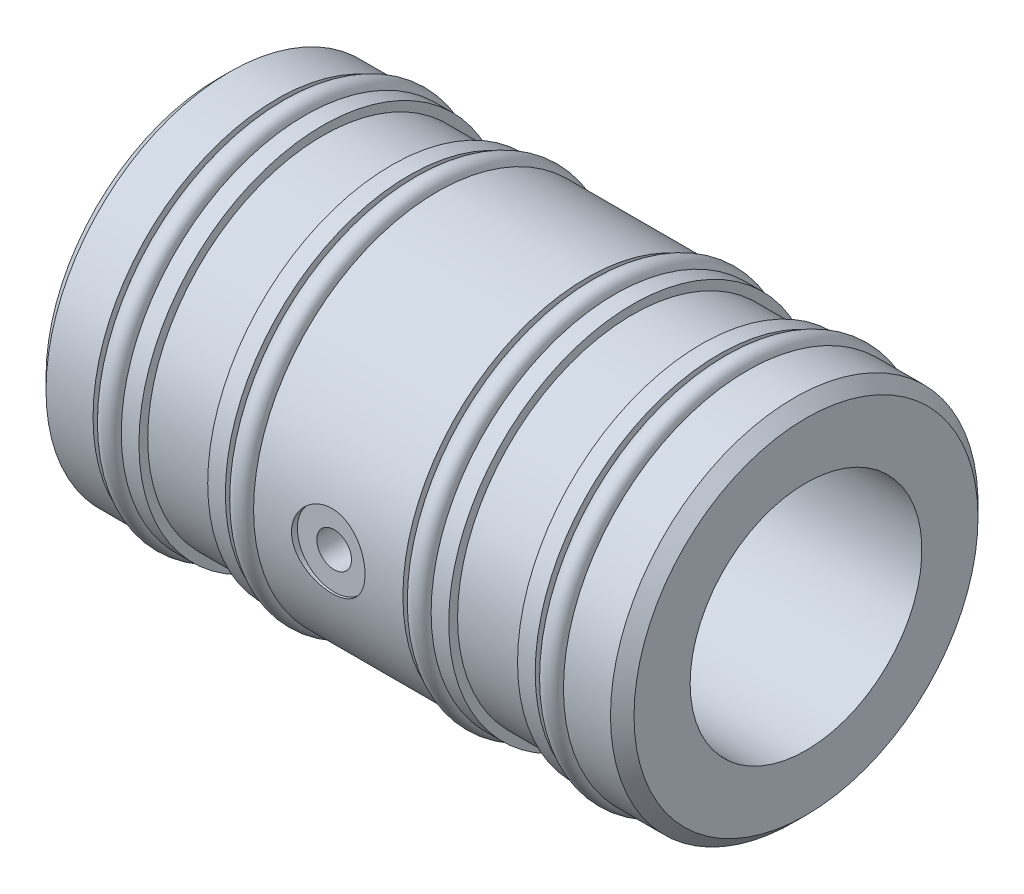
ISO-10303-21;
HEADER;
FILE_DESCRIPTION(('STEP AP214'),'2;1');
FILE_NAME('part.step','',(''),(''),'','','');
FILE_SCHEMA(('AUTOMOTIVE_DESIGN { 1 0 10303 214 1 1 1 1 }'));
ENDSEC;
DATA;
#1=APPLICATION_CONTEXT('core data for automotive mechanical design processes');
#2=APPLICATION_PROTOCOL_DEFINITION('international standard','automotive_design',2000,#1);
#3=PRODUCT_CONTEXT('',#1,'mechanical');
#4=PRODUCT('Part','Part','',(#3));
#5=PRODUCT_RELATED_PRODUCT_CATEGORY('part','',(#4));
#6=PRODUCT_DEFINITION_FORMATION('','',#4);
#7=PRODUCT_DEFINITION_CONTEXT('part definition',#1,'design');
#8=PRODUCT_DEFINITION('design','',#6,#7);
#9=PRODUCT_DEFINITION_SHAPE('','',#8);
#10=(LENGTH_UNIT() NAMED_UNIT(*) SI_UNIT(.MILLI.,.METRE.));
#11=(NAMED_UNIT(*) PLANE_ANGLE_UNIT() SI_UNIT($,.RADIAN.));
#12=(NAMED_UNIT(*) SI_UNIT($,.STERADIAN.) SOLID_ANGLE_UNIT());
#13=UNCERTAINTY_MEASURE_WITH_UNIT(LENGTH_MEASURE(1.E-05),#10,'distance_accuracy_value','');
#14=(GEOMETRIC_REPRESENTATION_CONTEXT(3) GLOBAL_UNCERTAINTY_ASSIGNED_CONTEXT((#13)) GLOBAL_UNIT_ASSIGNED_CONTEXT((#10,
#11,#12)) REPRESENTATION_CONTEXT('',''));
#15=CARTESIAN_POINT('',(0.,0.,0.));
#16=DIRECTION('',(0.,0.,1.));
#17=DIRECTION('',(1.,0.,0.));
#18=AXIS2_PLACEMENT_3D('',#15,#16,#17);
#19=CARTESIAN_POINT('',(0.,0.,0.));
#20=DIRECTION('',(-1.,0.,0.));
#21=DIRECTION('',(0.,0.,1.));
#22=AXIS2_PLACEMENT_3D('',#19,#20,#21);
#23=CYLINDRICAL_SURFACE('',#22,14.605);
#24=CARTESIAN_POINT('',(5.08,0.,0.));
#25=DIRECTION('',(-1.,0.,0.));
#26=DIRECTION('',(0.,0.,1.));
#27=AXIS2_PLACEMENT_3D('',#24,#25,#26);
#28=CIRCLE('',#27,14.605);
#29=CARTESIAN_POINT('',(5.08,0.,14.605));
#30=VERTEX_POINT('',#29);
#31=EDGE_CURVE('E200',#30,#30,#28,.T.);
#32=ORIENTED_EDGE('',*,*,#31,.F.);
#33=EDGE_LOOP('',(#32));
#34=FACE_BOUND('',#33,.T.);
#35=CARTESIAN_POINT('',(6.23212802387815,0.,0.));
#36=DIRECTION('',(1.,0.,0.));
#37=DIRECTION('',(0.,0.,-1.));
#38=AXIS2_PLACEMENT_3D('',#35,#36,#37);
#39=CIRCLE('',#38,14.605);
#40=CARTESIAN_POINT('',(6.23212802387815,0.,-14.605));
#41=VERTEX_POINT('',#40);
#42=EDGE_CURVE('E13',#41,#41,#39,.T.);
#43=ORIENTED_EDGE('',*,*,#42,.F.);
#44=EDGE_LOOP('',(#43));
#45=FACE_BOUND('',#44,.T.);
#46=ADVANCED_FACE('F44',(#34,#45),#23,.T.);
#47=CARTESIAN_POINT('',(7.518,0.,0.));
#48=DIRECTION('',(-1.,0.,0.));
#49=DIRECTION('',(0.,0.,1.));
#50=AXIS2_PLACEMENT_3D('',#47,#48,#49);
#51=CIRCLE('',#50,14.605);
#52=CARTESIAN_POINT('',(7.518,0.,14.605));
#53=VERTEX_POINT('',#52);
#54=EDGE_CURVE('E283',#53,#53,#51,.T.);
#55=ORIENTED_EDGE('',*,*,#54,.T.);
#56=EDGE_LOOP('',(#55));
#57=FACE_BOUND('',#56,.T.);
#58=CARTESIAN_POINT('',(6.36547197612185,0.,0.));
#59=DIRECTION('',(-1.,0.,0.));
#60=DIRECTION('',(0.,0.,1.));
#61=AXIS2_PLACEMENT_3D('',#58,#59,#60);
#62=CIRCLE('',#61,14.605);
#63=CARTESIAN_POINT('',(6.36547197612185,0.,14.605));
#64=VERTEX_POINT('',#63);
#65=EDGE_CURVE('E52',#64,#64,#62,.T.);
#66=ORIENTED_EDGE('',*,*,#65,.F.);
#67=EDGE_LOOP('',(#66));
#68=FACE_BOUND('',#67,.T.);
#69=ADVANCED_FACE('F157',(#57,#68),#23,.T.);
#70=CARTESIAN_POINT('',(0.,0.,0.));
#71=DIRECTION('',(-1.,0.,0.));
#72=DIRECTION('',(0.,0.,1.));
#73=AXIS2_PLACEMENT_3D('',#70,#71,#72);
#74=CYLINDRICAL_SURFACE('',#73,14.605);
#75=CARTESIAN_POINT('',(16.51,0.,0.));
#76=DIRECTION('',(-1.,0.,0.));
#77=DIRECTION('',(0.,0.,1.));
#78=AXIS2_PLACEMENT_3D('',#75,#76,#77);
#79=CIRCLE('',#78,14.605);
#80=CARTESIAN_POINT('',(16.51,0.,14.605));
#81=VERTEX_POINT('',#80);
#82=EDGE_CURVE('E262',#81,#81,#79,.T.);
#83=ORIENTED_EDGE('',*,*,#82,.F.);
#84=EDGE_LOOP('',(#83));
#85=FACE_BOUND('',#84,.T.);
#86=CARTESIAN_POINT('',(17.6613280238782,0.,0.));
#87=DIRECTION('',(1.,0.,0.));
#88=DIRECTION('',(0.,0.,-1.));
#89=AXIS2_PLACEMENT_3D('',#86,#87,#88);
#90=CIRCLE('',#89,14.605);
#91=CARTESIAN_POINT('',(17.6613280238782,0.,-14.605));
#92=VERTEX_POINT('',#91);
#93=EDGE_CURVE('E334',#92,#92,#90,.T.);
#94=ORIENTED_EDGE('',*,*,#93,.F.);
#95=EDGE_LOOP('',(#94));
#96=FACE_BOUND('',#95,.T.);
#97=ADVANCED_FACE('F163',(#85,#96),#74,.T.);
#98=CARTESIAN_POINT('',(18.948,0.,0.));
#99=DIRECTION('',(-1.,0.,0.));
#100=DIRECTION('',(0.,0.,1.));
#101=AXIS2_PLACEMENT_3D('',#98,#99,#100);
#102=CIRCLE('',#101,14.605);
#103=CARTESIAN_POINT('',(18.948,0.,14.605));
#104=VERTEX_POINT('',#103);
#105=EDGE_CURVE('E259',#104,#104,#102,.T.);
#106=ORIENTED_EDGE('',*,*,#105,.T.);
#107=EDGE_LOOP('',(#106));
#108=FACE_BOUND('',#107,.T.);
#109=CARTESIAN_POINT('',(17.7946719761218,0.,0.));
#110=DIRECTION('',(-1.,0.,0.));
#111=DIRECTION('',(0.,0.,1.));
#112=AXIS2_PLACEMENT_3D('',#109,#110,#111);
#113=CIRCLE('',#112,14.605);
#114=CARTESIAN_POINT('',(17.7946719761218,0.,14.605));
#115=VERTEX_POINT('',#114);
#116=EDGE_CURVE('E336',#115,#115,#113,.T.);
#117=ORIENTED_EDGE('',*,*,#116,.F.);
#118=EDGE_LOOP('',(#117));
#119=FACE_BOUND('',#118,.T.);
#120=ADVANCED_FACE('F146',(#108,#119),#74,.T.);
#121=CARTESIAN_POINT('',(0.,0.,0.));
#122=DIRECTION('',(-1.,0.,0.));
#123=DIRECTION('',(0.,0.,1.));
#124=AXIS2_PLACEMENT_3D('',#121,#122,#123);
#125=CYLINDRICAL_SURFACE('',#124,14.605);
#126=CARTESIAN_POINT('',(31.85,0.,0.));
#127=DIRECTION('',(-1.,0.,0.));
#128=DIRECTION('',(0.,0.,1.));
#129=AXIS2_PLACEMENT_3D('',#126,#127,#128);
#130=CIRCLE('',#129,14.605);
#131=CARTESIAN_POINT('',(31.85,0.,14.605));
#132=VERTEX_POINT('',#131);
#133=EDGE_CURVE('E250',#132,#132,#130,.T.);
#134=ORIENTED_EDGE('',*,*,#133,.F.);
#135=EDGE_LOOP('',(#134));
#136=FACE_BOUND('',#135,.T.);
#137=CARTESIAN_POINT('',(33.0033280238781,0.,0.));
#138=DIRECTION('',(1.,0.,0.));
#139=DIRECTION('',(0.,0.,-1.));
#140=AXIS2_PLACEMENT_3D('',#137,#138,#139);
#141=CIRCLE('',#140,14.605);
#142=CARTESIAN_POINT('',(33.0033280238781,0.,-14.605));
#143=VERTEX_POINT('',#142);
#144=EDGE_CURVE('E340',#143,#143,#141,.T.);
#145=ORIENTED_EDGE('',*,*,#144,.F.);
#146=EDGE_LOOP('',(#145));
#147=FACE_BOUND('',#146,.T.);
#148=ADVANCED_FACE('F144',(#136,#147),#125,.T.);
#149=CARTESIAN_POINT('',(34.288,0.,0.));
#150=DIRECTION('',(-1.,0.,0.));
#151=DIRECTION('',(0.,0.,1.));
#152=AXIS2_PLACEMENT_3D('',#149,#150,#151);
#153=CIRCLE('',#152,14.605);
#154=CARTESIAN_POINT('',(34.288,0.,14.605));
#155=VERTEX_POINT('',#154);
#156=EDGE_CURVE('E247',#155,#155,#153,.T.);
#157=ORIENTED_EDGE('',*,*,#156,.T.);
#158=EDGE_LOOP('',(#157));
#159=FACE_BOUND('',#158,.T.);
#160=CARTESIAN_POINT('',(33.1366719761219,0.,0.));
#161=DIRECTION('',(-1.,0.,0.));
#162=DIRECTION('',(0.,0.,1.));
#163=AXIS2_PLACEMENT_3D('',#160,#161,#162);
#164=CIRCLE('',#163,14.605);
#165=CARTESIAN_POINT('',(33.1366719761219,0.,14.605));
#166=VERTEX_POINT('',#165);
#167=EDGE_CURVE('E345',#166,#166,#164,.T.);
#168=ORIENTED_EDGE('',*,*,#167,.F.);
#169=EDGE_LOOP('',(#168));
#170=FACE_BOUND('',#169,.T.);
#171=ADVANCED_FACE('F114',(#159,#170),#125,.T.);
#172=CARTESIAN_POINT('',(0.,0.,0.));
#173=DIRECTION('',(-1.,0.,0.));
#174=DIRECTION('',(0.,0.,1.));
#175=AXIS2_PLACEMENT_3D('',#172,#173,#174);
#176=CYLINDRICAL_SURFACE('',#175,14.605);
#177=CARTESIAN_POINT('',(43.28,0.,0.));
#178=DIRECTION('',(-1.,0.,0.));
#179=DIRECTION('',(0.,0.,1.));
#180=AXIS2_PLACEMENT_3D('',#177,#178,#179);
#181=CIRCLE('',#180,14.605);
#182=CARTESIAN_POINT('',(43.28,0.,14.605));
#183=VERTEX_POINT('',#182);
#184=EDGE_CURVE('E226',#183,#183,#181,.T.);
#185=ORIENTED_EDGE('',*,*,#184,.F.);
#186=EDGE_LOOP('',(#185));
#187=FACE_BOUND('',#186,.T.);
#188=CARTESIAN_POINT('',(44.4333280238781,0.,0.));
#189=DIRECTION('',(1.,0.,0.));
#190=DIRECTION('',(0.,0.,-1.));
#191=AXIS2_PLACEMENT_3D('',#188,#189,#190);
#192=CIRCLE('',#191,14.605);
#193=CARTESIAN_POINT('',(44.4333280238781,0.,-14.605));
#194=VERTEX_POINT('',#193);
#195=EDGE_CURVE('E69',#194,#194,#192,.T.);
#196=ORIENTED_EDGE('',*,*,#195,.F.);
#197=EDGE_LOOP('',(#196));
#198=FACE_BOUND('',#197,.T.);
#199=ADVANCED_FACE('F110',(#187,#198),#176,.T.);
#200=CARTESIAN_POINT('',(45.718,0.,0.));
#201=DIRECTION('',(-1.,0.,0.));
#202=DIRECTION('',(0.,0.,1.));
#203=AXIS2_PLACEMENT_3D('',#200,#201,#202);
#204=CIRCLE('',#203,14.605);
#205=CARTESIAN_POINT('',(45.718,0.,14.605));
#206=VERTEX_POINT('',#205);
#207=EDGE_CURVE('E217',#206,#206,#204,.T.);
#208=ORIENTED_EDGE('',*,*,#207,.T.);
#209=EDGE_LOOP('',(#208));
#210=FACE_BOUND('',#209,.T.);
#211=CARTESIAN_POINT('',(44.5666719761219,0.,0.));
#212=DIRECTION('',(-1.,0.,0.));
#213=DIRECTION('',(0.,0.,1.));
#214=AXIS2_PLACEMENT_3D('',#211,#212,#213);
#215=CIRCLE('',#214,14.605);
#216=CARTESIAN_POINT('',(44.5666719761219,0.,14.605));
#217=VERTEX_POINT('',#216);
#218=EDGE_CURVE('E67',#217,#217,#215,.T.);
#219=ORIENTED_EDGE('',*,*,#218,.F.);
#220=EDGE_LOOP('',(#219));
#221=FACE_BOUND('',#220,.T.);
#222=ADVANCED_FACE('F113',(#210,#221),#176,.T.);
#223=CARTESIAN_POINT('',(0.,10.01,0.));
#224=DIRECTION('',(1.,0.,0.));
#225=DIRECTION('',(0.,0.,-1.));
#226=AXIS2_PLACEMENT_3D('',#223,#224,#225);
#227=PLANE('',#226);
#228=CARTESIAN_POINT('',(0.,0.,0.));
#229=DIRECTION('',(1.,0.,0.));
#230=DIRECTION('',(0.,0.,-1.));
#231=AXIS2_PLACEMENT_3D('',#228,#229,#230);
#232=CIRCLE('',#231,14.859);
#233=CARTESIAN_POINT('',(0.,0.,-14.859));
#234=VERTEX_POINT('',#233);
#235=EDGE_CURVE('E194',#234,#234,#232,.F.);
#236=ORIENTED_EDGE('',*,*,#235,.T.);
#237=EDGE_LOOP('',(#236));
#238=FACE_BOUND('',#237,.T.);
#239=CARTESIAN_POINT('',(0.,0.,0.));
#240=DIRECTION('',(-1.,0.,0.));
#241=DIRECTION('',(0.,0.,1.));
#242=AXIS2_PLACEMENT_3D('',#239,#240,#241);
#243=CIRCLE('',#242,10.01);
#244=CARTESIAN_POINT('',(0.,0.,10.01));
#245=VERTEX_POINT('',#244);
#246=EDGE_CURVE('E214',#245,#245,#243,.T.);
#247=ORIENTED_EDGE('',*,*,#246,.F.);
#248=EDGE_LOOP('',(#247));
#249=FACE_BOUND('',#248,.T.);
#250=ADVANCED_FACE('F178',(#238,#249),#227,.F.);
#251=CARTESIAN_POINT('',(0.,0.,0.));
#252=DIRECTION('',(-1.,0.,0.));
#253=DIRECTION('',(0.,0.,1.));
#254=AXIS2_PLACEMENT_3D('',#251,#252,#253);
#255=CYLINDRICAL_SURFACE('',#254,15.875);
#256=CARTESIAN_POINT('',(1.01600000000001,0.,0.));
#257=DIRECTION('',(1.,0.,0.));
#258=DIRECTION('',(0.,0.,-1.));
#259=AXIS2_PLACEMENT_3D('',#256,#257,#258);
#260=CIRCLE('',#259,15.875);
#261=CARTESIAN_POINT('',(1.01600000000001,0.,-15.875));
#262=VERTEX_POINT('',#261);
#263=EDGE_CURVE('E191',#262,#262,#260,.T.);
#264=ORIENTED_EDGE('',*,*,#263,.T.);
#265=EDGE_LOOP('',(#264));
#266=FACE_BOUND('',#265,.T.);
#267=CARTESIAN_POINT('',(5.08,0.,0.));
#268=DIRECTION('',(-1.,0.,0.));
#269=DIRECTION('',(0.,0.,1.));
#270=AXIS2_PLACEMENT_3D('',#267,#268,#269);
#271=CIRCLE('',#270,15.875);
#272=CARTESIAN_POINT('',(5.08,0.,15.875));
#273=VERTEX_POINT('',#272);
#274=EDGE_CURVE('E195',#273,#273,#271,.T.);
#275=ORIENTED_EDGE('',*,*,#274,.T.);
#276=EDGE_LOOP('',(#275));
#277=FACE_BOUND('',#276,.T.);
#278=ADVANCED_FACE('F174',(#266,#277),#255,.T.);
#279=CARTESIAN_POINT('',(5.08,15.875,0.));
#280=DIRECTION('',(-1.,0.,0.));
#281=DIRECTION('',(0.,0.,1.));
#282=AXIS2_PLACEMENT_3D('',#279,#280,#281);
#283=PLANE('',#282);
#284=ORIENTED_EDGE('',*,*,#274,.F.);
#285=EDGE_LOOP('',(#284));
#286=FACE_BOUND('',#285,.T.);
#287=ORIENTED_EDGE('',*,*,#31,.T.);
#288=EDGE_LOOP('',(#287));
#289=FACE_BOUND('',#288,.T.);
#290=ADVANCED_FACE('F171',(#286,#289),#283,.F.);
#291=CARTESIAN_POINT('',(7.518,14.605,0.));
#292=DIRECTION('',(1.,0.,0.));
#293=DIRECTION('',(0.,0.,-1.));
#294=AXIS2_PLACEMENT_3D('',#291,#292,#293);
#295=PLANE('',#294);
#296=ORIENTED_EDGE('',*,*,#54,.F.);
#297=EDGE_LOOP('',(#296));
#298=FACE_BOUND('',#297,.T.);
#299=CARTESIAN_POINT('',(7.518,0.,0.));
#300=DIRECTION('',(-1.,0.,0.));
#301=DIRECTION('',(0.,0.,1.));
#302=AXIS2_PLACEMENT_3D('',#299,#300,#301);
#303=CIRCLE('',#302,15.875);
#304=CARTESIAN_POINT('',(7.518,0.,15.875));
#305=VERTEX_POINT('',#304);
#306=EDGE_CURVE('E280',#305,#305,#303,.T.);
#307=ORIENTED_EDGE('',*,*,#306,.T.);
#308=EDGE_LOOP('',(#307));
#309=FACE_BOUND('',#308,.T.);
#310=ADVANCED_FACE('F169',(#298,#309),#295,.F.);
#311=CARTESIAN_POINT('',(0.,0.,0.));
#312=DIRECTION('',(-1.,0.,0.));
#313=DIRECTION('',(0.,0.,1.));
#314=AXIS2_PLACEMENT_3D('',#311,#312,#313);
#315=CYLINDRICAL_SURFACE('',#314,15.875);
#316=ORIENTED_EDGE('',*,*,#306,.F.);
#317=EDGE_LOOP('',(#316));
#318=FACE_BOUND('',#317,.T.);
#319=CARTESIAN_POINT('',(9.042,0.,0.));
#320=DIRECTION('',(-1.,0.,0.));
#321=DIRECTION('',(0.,0.,1.));
#322=AXIS2_PLACEMENT_3D('',#319,#320,#321);
#323=CIRCLE('',#322,15.875);
#324=CARTESIAN_POINT('',(9.042,0.,15.875));
#325=VERTEX_POINT('',#324);
#326=EDGE_CURVE('E277',#325,#325,#323,.T.);
#327=ORIENTED_EDGE('',*,*,#326,.T.);
#328=EDGE_LOOP('',(#327));
#329=FACE_BOUND('',#328,.T.);
#330=ADVANCED_FACE('F292',(#318,#329),#315,.T.);
#331=CARTESIAN_POINT('',(9.042,15.875,0.));
#332=DIRECTION('',(-1.,0.,0.));
#333=DIRECTION('',(0.,0.,1.));
#334=AXIS2_PLACEMENT_3D('',#331,#332,#333);
#335=PLANE('',#334);
#336=ORIENTED_EDGE('',*,*,#326,.F.);
#337=EDGE_LOOP('',(#336));
#338=FACE_BOUND('',#337,.T.);
#339=CARTESIAN_POINT('',(9.042,0.,0.));
#340=DIRECTION('',(-1.,0.,0.));
#341=DIRECTION('',(0.,0.,1.));
#342=AXIS2_PLACEMENT_3D('',#339,#340,#341);
#343=CIRCLE('',#342,15.113);
#344=CARTESIAN_POINT('',(9.042,0.,15.113));
#345=VERTEX_POINT('',#344);
#346=EDGE_CURVE('E274',#345,#345,#343,.T.);
#347=ORIENTED_EDGE('',*,*,#346,.T.);
#348=EDGE_LOOP('',(#347));
#349=FACE_BOUND('',#348,.T.);
#350=ADVANCED_FACE('F297',(#338,#349),#335,.F.);
#351=CARTESIAN_POINT('',(0.,0.,0.));
#352=DIRECTION('',(-1.,0.,0.));
#353=DIRECTION('',(0.,0.,1.));
#354=AXIS2_PLACEMENT_3D('',#351,#352,#353);
#355=CYLINDRICAL_SURFACE('',#354,15.113);
#356=ORIENTED_EDGE('',*,*,#346,.F.);
#357=EDGE_LOOP('',(#356));
#358=FACE_BOUND('',#357,.T.);
#359=CARTESIAN_POINT('',(14.986,0.,0.));
#360=DIRECTION('',(-1.,0.,0.));
#361=DIRECTION('',(0.,0.,1.));
#362=AXIS2_PLACEMENT_3D('',#359,#360,#361);
#363=CIRCLE('',#362,15.113);
#364=CARTESIAN_POINT('',(14.986,0.,15.113));
#365=VERTEX_POINT('',#364);
#366=EDGE_CURVE('E271',#365,#365,#363,.T.);
#367=ORIENTED_EDGE('',*,*,#366,.T.);
#368=EDGE_LOOP('',(#367));
#369=FACE_BOUND('',#368,.T.);
#370=ADVANCED_FACE('F302',(#358,#369),#355,.T.);
#371=CARTESIAN_POINT('',(14.986,15.113,0.));
#372=DIRECTION('',(1.,0.,0.));
#373=DIRECTION('',(0.,0.,-1.));
#374=AXIS2_PLACEMENT_3D('',#371,#372,#373);
#375=PLANE('',#374);
#376=ORIENTED_EDGE('',*,*,#366,.F.);
#377=EDGE_LOOP('',(#376));
#378=FACE_BOUND('',#377,.T.);
#379=CARTESIAN_POINT('',(14.986,0.,0.));
#380=DIRECTION('',(-1.,0.,0.));
#381=DIRECTION('',(0.,0.,1.));
#382=AXIS2_PLACEMENT_3D('',#379,#380,#381);
#383=CIRCLE('',#382,15.875);
#384=CARTESIAN_POINT('',(14.986,0.,15.875));
#385=VERTEX_POINT('',#384);
#386=EDGE_CURVE('E268',#385,#385,#383,.T.);
#387=ORIENTED_EDGE('',*,*,#386,.T.);
#388=EDGE_LOOP('',(#387));
#389=FACE_BOUND('',#388,.T.);
#390=ADVANCED_FACE('F308',(#378,#389),#375,.F.);
#391=CARTESIAN_POINT('',(0.,0.,0.));
#392=DIRECTION('',(-1.,0.,0.));
#393=DIRECTION('',(0.,0.,1.));
#394=AXIS2_PLACEMENT_3D('',#391,#392,#393);
#395=CYLINDRICAL_SURFACE('',#394,15.875);
#396=ORIENTED_EDGE('',*,*,#386,.F.);
#397=EDGE_LOOP('',(#396));
#398=FACE_BOUND('',#397,.T.);
#399=CARTESIAN_POINT('',(16.51,0.,0.));
#400=DIRECTION('',(-1.,0.,0.));
#401=DIRECTION('',(0.,0.,1.));
#402=AXIS2_PLACEMENT_3D('',#399,#400,#401);
#403=CIRCLE('',#402,15.875);
#404=CARTESIAN_POINT('',(16.51,0.,15.875));
#405=VERTEX_POINT('',#404);
#406=EDGE_CURVE('E265',#405,#405,#403,.T.);
#407=ORIENTED_EDGE('',*,*,#406,.T.);
#408=EDGE_LOOP('',(#407));
#409=FACE_BOUND('',#408,.T.);
#410=ADVANCED_FACE('F314',(#398,#409),#395,.T.);
#411=CARTESIAN_POINT('',(16.51,15.875,0.));
#412=DIRECTION('',(-1.,0.,0.));
#413=DIRECTION('',(0.,0.,1.));
#414=AXIS2_PLACEMENT_3D('',#411,#412,#413);
#415=PLANE('',#414);
#416=ORIENTED_EDGE('',*,*,#406,.F.);
#417=EDGE_LOOP('',(#416));
#418=FACE_BOUND('',#417,.T.);
#419=ORIENTED_EDGE('',*,*,#82,.T.);
#420=EDGE_LOOP('',(#419));
#421=FACE_BOUND('',#420,.T.);
#422=ADVANCED_FACE('F320',(#418,#421),#415,.F.);
#423=CARTESIAN_POINT('',(18.948,14.605,0.));
#424=DIRECTION('',(1.,0.,0.));
#425=DIRECTION('',(0.,0.,-1.));
#426=AXIS2_PLACEMENT_3D('',#423,#424,#425);
#427=PLANE('',#426);
#428=ORIENTED_EDGE('',*,*,#105,.F.);
#429=EDGE_LOOP('',(#428));
#430=FACE_BOUND('',#429,.T.);
#431=CARTESIAN_POINT('',(18.948,0.,0.));
#432=DIRECTION('',(-1.,0.,0.));
#433=DIRECTION('',(0.,0.,1.));
#434=AXIS2_PLACEMENT_3D('',#431,#432,#433);
#435=CIRCLE('',#434,15.875);
#436=CARTESIAN_POINT('',(18.948,0.,15.875));
#437=VERTEX_POINT('',#436);
#438=EDGE_CURVE('E256',#437,#437,#435,.T.);
#439=ORIENTED_EDGE('',*,*,#438,.T.);
#440=EDGE_LOOP('',(#439));
#441=FACE_BOUND('',#440,.T.);
#442=ADVANCED_FACE('F153',(#430,#441),#427,.F.);
#443=CARTESIAN_POINT('',(0.,0.,0.));
#444=DIRECTION('',(-1.,0.,0.));
#445=DIRECTION('',(0.,0.,1.));
#446=AXIS2_PLACEMENT_3D('',#443,#444,#445);
#447=CYLINDRICAL_SURFACE('',#446,15.875);
#448=CARTESIAN_POINT('',(28.575,0.,15.875));
#449=CARTESIAN_POINT('',(28.5749935087178,-0.17645667906661,15.8749967481927));
#450=CARTESIAN_POINT('',(28.5602399235777,-0.352995421139834,15.8720277294088));
#451=CARTESIAN_POINT('',(28.5016622621341,-0.701082886912636,15.8604701085376));
#452=CARTESIAN_POINT('',(28.4578150908552,-0.872627533193804,15.8518770420609));
#453=CARTESIAN_POINT('',(28.342458956254,-1.20564371921102,15.8300308645856));
#454=CARTESIAN_POINT('',(28.2709764880181,-1.3671247356877,15.8167822181858));
#455=CARTESIAN_POINT('',(28.1024576141516,-1.67579036464392,15.7870651376212));
#456=CARTESIAN_POINT('',(28.0054227304471,-1.8229758278657,15.7705968952337));
#457=CARTESIAN_POINT('',(27.7871602806247,-2.1008767904747,15.7360037492265));
#458=CARTESIAN_POINT('',(27.6656534716329,-2.23137079492832,15.717861169763));
#459=CARTESIAN_POINT('',(27.4024965779563,-2.47026670223049,15.6820927293697));
#460=CARTESIAN_POINT('',(27.260844921511,-2.5786668796461,15.6644669088885));
#461=CARTESIAN_POINT('',(26.9598260871873,-2.77124081687869,15.6315550275505));
#462=CARTESIAN_POINT('',(26.8003094809466,-2.85518523089913,15.616291708837));
#463=CARTESIAN_POINT('',(26.469080224662,-2.99499549139248,15.5900840108548));
#464=CARTESIAN_POINT('',(26.2973687813754,-3.05086411173823,15.5791392049423));
#465=CARTESIAN_POINT('',(25.9490071445924,-3.13221782713433,15.5629865667575));
#466=CARTESIAN_POINT('',(25.7724511723484,-3.15809153101912,15.5577054259032));
#467=CARTESIAN_POINT('',(25.4174313171682,-3.17992800553043,15.5532574081749));
#468=CARTESIAN_POINT('',(25.2389676311835,-3.17589383461536,15.5540899061039));
#469=CARTESIAN_POINT('',(24.8880414480333,-3.13834326959827,15.5617084989549));
#470=CARTESIAN_POINT('',(24.7155290371333,-3.1052723652744,15.5684046282657));
#471=CARTESIAN_POINT('',(24.378551456595,-3.01129028367818,15.58685434058));
#472=CARTESIAN_POINT('',(24.2140866716821,-2.95037777684466,15.5986081651095));
#473=CARTESIAN_POINT('',(23.8965890440911,-2.80201618816723,15.625940887388));
#474=CARTESIAN_POINT('',(23.7436409823679,-2.71439053016196,15.6415451015851));
#475=CARTESIAN_POINT('',(23.4544525513363,-2.51521459926825,15.6748041460447));
#476=CARTESIAN_POINT('',(23.3182141049976,-2.40366157683293,15.6924592118681));
#477=CARTESIAN_POINT('',(23.0637416471992,-2.15741229222985,15.7282204244164));
#478=CARTESIAN_POINT('',(22.9458755970473,-2.02233581184951,15.7463289724462));
#479=CARTESIAN_POINT('',(22.7344165379936,-1.73413745139688,15.7806659466825));
#480=CARTESIAN_POINT('',(22.6408238403929,-1.58101533992956,15.7968943487749));
#481=CARTESIAN_POINT('',(22.4805001582075,-1.26066355334057,15.8256824126082));
#482=CARTESIAN_POINT('',(22.4138112376786,-1.09341227718333,15.8382363209326));
#483=CARTESIAN_POINT('',(22.3095804949275,-0.74977300022451,15.8582172353645));
#484=CARTESIAN_POINT('',(22.2720351419162,-0.573386108980027,15.8656448625169));
#485=CARTESIAN_POINT('',(22.2276782592032,-0.219644612866203,15.8744498317731));
#486=CARTESIAN_POINT('',(22.2203631679596,-0.0423555424337052,15.8759262952159));
#487=CARTESIAN_POINT('',(22.2353183021414,0.310911666061866,15.8729378987808));
#488=CARTESIAN_POINT('',(22.2575868644445,0.486889877259043,15.8684733728909));
#489=CARTESIAN_POINT('',(22.3306588360021,0.830915470330267,15.8541666662546));
#490=CARTESIAN_POINT('',(22.3812038674808,0.999019935979192,15.8443732008336));
#491=CARTESIAN_POINT('',(22.5091116449322,1.32436751731144,15.8205027779378));
#492=CARTESIAN_POINT('',(22.5864764000989,1.48160981819919,15.8064254995517));
#493=CARTESIAN_POINT('',(22.7669169078179,1.78289322645374,15.7753021911821));
#494=CARTESIAN_POINT('',(22.8702958297986,1.9267491524382,15.7582219263764));
#495=CARTESIAN_POINT('',(23.0994241820831,2.19525221070348,15.7230678308488));
#496=CARTESIAN_POINT('',(23.2251760108196,2.31989728085517,15.7049938937463));
#497=CARTESIAN_POINT('',(23.4977728922543,2.54838387570801,15.6695553879336));
#498=CARTESIAN_POINT('',(23.6449099879027,2.65187970527448,15.6522058124074));
#499=CARTESIAN_POINT('',(23.9547760723075,2.83268870866258,15.6204980895292));
#500=CARTESIAN_POINT('',(24.117504436896,2.91000293005522,15.6061398224986));
#501=CARTESIAN_POINT('',(24.4531141815248,3.03578209702272,15.5821615135542));
#502=CARTESIAN_POINT('',(24.6259376708428,3.08439661183659,15.5725169521919));
#503=CARTESIAN_POINT('',(24.9775137148336,3.15184996891635,15.5590061181468));
#504=CARTESIAN_POINT('',(25.1562654932147,3.17069269411473,15.5551390919428));
#505=CARTESIAN_POINT('',(25.5111531449282,3.17792389200421,15.5536630007963));
#506=CARTESIAN_POINT('',(25.6872776478433,3.1668586271251,15.5559416842603));
#507=CARTESIAN_POINT('',(26.0351004884485,3.11579356551769,15.5662494581365));
#508=CARTESIAN_POINT('',(26.206798861681,3.07579400121052,15.5742785023576));
#509=CARTESIAN_POINT('',(26.5405479831887,2.96823945498418,15.5951321389583));
#510=CARTESIAN_POINT('',(26.7026210945952,2.90075145882757,15.6079450673479));
#511=CARTESIAN_POINT('',(27.0132293133319,2.74019849661009,15.6369294504299));
#512=CARTESIAN_POINT('',(27.1617632840773,2.64713138586025,15.6531011867149));
#513=CARTESIAN_POINT('',(27.4437969415772,2.43619627944687,15.6873244966124));
#514=CARTESIAN_POINT('',(27.5769983297246,2.3179337919717,15.705403339883));
#515=CARTESIAN_POINT('',(27.8218462025551,2.06077937161672,15.7412080994346));
#516=CARTESIAN_POINT('',(27.9334877267573,1.92188270421184,15.7589339336561));
#517=CARTESIAN_POINT('',(28.13314999453,1.62565597235519,15.7922541783181));
#518=CARTESIAN_POINT('',(28.2209113104141,1.46814820806473,15.8078243412111));
#519=CARTESIAN_POINT('',(28.3685809392442,1.14035319598683,15.8348402214487));
#520=CARTESIAN_POINT('',(28.4285143567657,0.970077628240428,15.8462896541511));
#521=CARTESIAN_POINT('',(28.507219935042,0.666183227333001,15.861549829903));
#522=CARTESIAN_POINT('',(28.5325921400221,0.534294283243766,15.8665641252808));
#523=CARTESIAN_POINT('',(28.5664843717378,0.268285992541962,15.8732903939416));
#524=CARTESIAN_POINT('',(28.5750049355685,0.134166717151865,15.8750024724727));
#525=CARTESIAN_POINT('',(28.575,0.,15.875));
#526=B_SPLINE_CURVE_WITH_KNOTS('',3,(#448,#449,#450,#451,#452,#453,#454,#455,#456,#457,#458,
#459,#460,#461,#462,#463,#464,#465,#466,#467,#468,#469,#470,#471,#472,#473,#474,#475,#476,#477,
#478,#479,#480,#481,#482,#483,#484,#485,#486,#487,#488,#489,#490,#491,#492,#493,#494,#495,#496,
#497,#498,#499,#500,#501,#502,#503,#504,#505,#506,#507,#508,#509,#510,#511,#512,#513,#514,#515,
#516,#517,#518,#519,#520,#521,#522,#523,#524,#525),.UNSPECIFIED.,.T.,.F.,(4,2,2,2,2,2,2,2,2,2,2,
2,2,2,2,2,2,2,2,2,2,2,2,2,2,2,2,2,2,2,2,2,2,2,2,2,2,2,4),(0.,0.528879214849496,1.05817876594495,
1.58697210941983,2.11573396458299,2.65091122760619,3.18613026967289,3.72621794143804,
4.26625224234502,4.7992088770389,5.3321110109289,5.85697733244934,6.38186872130592,
6.91030781396407,7.43880766330204,7.97681451660039,8.5148282693893,9.05367997661526,
9.59246639091264,10.1222408577214,10.6519855431373,11.1769669129355,11.7019876201087,
12.2334358465591,12.7649410799833,13.3045399573904,13.8441172419701,14.380857097789,
14.9175269444907,15.4444611915245,15.9713912058903,16.4970447697862,17.0227424207243,
17.5573714205928,18.0921232814205,18.6324715194515,19.1723313376812,19.5744711154541,
19.9765980760291),.UNSPECIFIED.);
#527=CARTESIAN_POINT('',(22.225,0.,15.875));
#528=VERTEX_POINT('',#527);
#529=CARTESIAN_POINT('',(28.575,0.,15.875));
#530=VERTEX_POINT('',#529);
#531=EDGE_CURVE('E60',#528,#530,#526,.T.);
#532=ORIENTED_EDGE('',*,*,#531,.T.);
#533=EDGE_CURVE('E58',#530,#528,#526,.T.);
#534=ORIENTED_EDGE('',*,*,#533,.T.);
#535=EDGE_LOOP('',(#532,#534));
#536=FACE_BOUND('',#535,.T.);
#537=ORIENTED_EDGE('',*,*,#438,.F.);
#538=EDGE_LOOP('',(#537));
#539=FACE_BOUND('',#538,.T.);
#540=CARTESIAN_POINT('',(31.85,0.,0.));
#541=DIRECTION('',(-1.,0.,0.));
#542=DIRECTION('',(0.,0.,1.));
#543=AXIS2_PLACEMENT_3D('',#540,#541,#542);
#544=CIRCLE('',#543,15.875);
#545=CARTESIAN_POINT('',(31.85,0.,15.875));
#546=VERTEX_POINT('',#545);
#547=EDGE_CURVE('E253',#546,#546,#544,.T.);
#548=ORIENTED_EDGE('',*,*,#547,.T.);
#549=EDGE_LOOP('',(#548));
#550=FACE_BOUND('',#549,.T.);
#551=ADVANCED_FACE('F65',(#536,#539,#550),#447,.T.);
#552=CARTESIAN_POINT('',(31.85,15.875,0.));
#553=DIRECTION('',(-1.,0.,0.));
#554=DIRECTION('',(0.,0.,1.));
#555=AXIS2_PLACEMENT_3D('',#552,#553,#554);
#556=PLANE('',#555);
#557=ORIENTED_EDGE('',*,*,#547,.F.);
#558=EDGE_LOOP('',(#557));
#559=FACE_BOUND('',#558,.T.);
#560=ORIENTED_EDGE('',*,*,#133,.T.);
#561=EDGE_LOOP('',(#560));
#562=FACE_BOUND('',#561,.T.);
#563=ADVANCED_FACE('F142',(#559,#562),#556,.F.);
#564=CARTESIAN_POINT('',(34.288,15.875,0.));
#565=DIRECTION('',(1.,0.,0.));
#566=DIRECTION('',(0.,0.,-1.));
#567=AXIS2_PLACEMENT_3D('',#564,#565,#566);
#568=PLANE('',#567);
#569=ORIENTED_EDGE('',*,*,#156,.F.);
#570=EDGE_LOOP('',(#569));
#571=FACE_BOUND('',#570,.T.);
#572=CARTESIAN_POINT('',(34.288,0.,0.));
#573=DIRECTION('',(-1.,0.,0.));
#574=DIRECTION('',(0.,0.,1.));
#575=AXIS2_PLACEMENT_3D('',#572,#573,#574);
#576=CIRCLE('',#575,15.875);
#577=CARTESIAN_POINT('',(34.288,0.,15.875));
#578=VERTEX_POINT('',#577);
#579=EDGE_CURVE('E244',#578,#578,#576,.T.);
#580=ORIENTED_EDGE('',*,*,#579,.T.);
#581=EDGE_LOOP('',(#580));
#582=FACE_BOUND('',#581,.T.);
#583=ADVANCED_FACE('F138',(#571,#582),#568,.F.);
#584=CARTESIAN_POINT('',(0.,0.,0.));
#585=DIRECTION('',(-1.,0.,0.));
#586=DIRECTION('',(0.,0.,1.));
#587=AXIS2_PLACEMENT_3D('',#584,#585,#586);
#588=CYLINDRICAL_SURFACE('',#587,15.875);
#589=ORIENTED_EDGE('',*,*,#579,.F.);
#590=EDGE_LOOP('',(#589));
#591=FACE_BOUND('',#590,.T.);
#592=CARTESIAN_POINT('',(35.81,0.,0.));
#593=DIRECTION('',(-1.,0.,0.));
#594=DIRECTION('',(0.,0.,1.));
#595=AXIS2_PLACEMENT_3D('',#592,#593,#594);
#596=CIRCLE('',#595,15.875);
#597=CARTESIAN_POINT('',(35.81,0.,15.875));
#598=VERTEX_POINT('',#597);
#599=EDGE_CURVE('E241',#598,#598,#596,.T.);
#600=ORIENTED_EDGE('',*,*,#599,.T.);
#601=EDGE_LOOP('',(#600));
#602=FACE_BOUND('',#601,.T.);
#603=ADVANCED_FACE('F134',(#591,#602),#588,.T.);
#604=CARTESIAN_POINT('',(35.81,15.113,0.));
#605=DIRECTION('',(-1.,0.,0.));
#606=DIRECTION('',(0.,0.,1.));
#607=AXIS2_PLACEMENT_3D('',#604,#605,#606);
#608=PLANE('',#607);
#609=ORIENTED_EDGE('',*,*,#599,.F.);
#610=EDGE_LOOP('',(#609));
#611=FACE_BOUND('',#610,.T.);
#612=CARTESIAN_POINT('',(35.81,0.,0.));
#613=DIRECTION('',(-1.,0.,0.));
#614=DIRECTION('',(0.,0.,1.));
#615=AXIS2_PLACEMENT_3D('',#612,#613,#614);
#616=CIRCLE('',#615,15.113);
#617=CARTESIAN_POINT('',(35.81,0.,15.113));
#618=VERTEX_POINT('',#617);
#619=EDGE_CURVE('E238',#618,#618,#616,.T.);
#620=ORIENTED_EDGE('',*,*,#619,.T.);
#621=EDGE_LOOP('',(#620));
#622=FACE_BOUND('',#621,.T.);
#623=ADVANCED_FACE('F130',(#611,#622),#608,.F.);
#624=CARTESIAN_POINT('',(0.,0.,0.));
#625=DIRECTION('',(-1.,0.,0.));
#626=DIRECTION('',(0.,0.,1.));
#627=AXIS2_PLACEMENT_3D('',#624,#625,#626);
#628=CYLINDRICAL_SURFACE('',#627,15.113);
#629=ORIENTED_EDGE('',*,*,#619,.F.);
#630=EDGE_LOOP('',(#629));
#631=FACE_BOUND('',#630,.T.);
#632=CARTESIAN_POINT('',(41.754,0.,0.));
#633=DIRECTION('',(-1.,0.,0.));
#634=DIRECTION('',(0.,0.,1.));
#635=AXIS2_PLACEMENT_3D('',#632,#633,#634);
#636=CIRCLE('',#635,15.113);
#637=CARTESIAN_POINT('',(41.754,0.,15.113));
#638=VERTEX_POINT('',#637);
#639=EDGE_CURVE('E235',#638,#638,#636,.T.);
#640=ORIENTED_EDGE('',*,*,#639,.T.);
#641=EDGE_LOOP('',(#640));
#642=FACE_BOUND('',#641,.T.);
#643=ADVANCED_FACE('F126',(#631,#642),#628,.T.);
#644=CARTESIAN_POINT('',(41.754,15.875,0.));
#645=DIRECTION('',(1.,0.,0.));
#646=DIRECTION('',(0.,0.,-1.));
#647=AXIS2_PLACEMENT_3D('',#644,#645,#646);
#648=PLANE('',#647);
#649=ORIENTED_EDGE('',*,*,#639,.F.);
#650=EDGE_LOOP('',(#649));
#651=FACE_BOUND('',#650,.T.);
#652=CARTESIAN_POINT('',(41.754,0.,0.));
#653=DIRECTION('',(-1.,0.,0.));
#654=DIRECTION('',(0.,0.,1.));
#655=AXIS2_PLACEMENT_3D('',#652,#653,#654);
#656=CIRCLE('',#655,15.875);
#657=CARTESIAN_POINT('',(41.754,0.,15.875));
#658=VERTEX_POINT('',#657);
#659=EDGE_CURVE('E232',#658,#658,#656,.T.);
#660=ORIENTED_EDGE('',*,*,#659,.T.);
#661=EDGE_LOOP('',(#660));
#662=FACE_BOUND('',#661,.T.);
#663=ADVANCED_FACE('F122',(#651,#662),#648,.F.);
#664=CARTESIAN_POINT('',(0.,0.,0.));
#665=DIRECTION('',(-1.,0.,0.));
#666=DIRECTION('',(0.,0.,1.));
#667=AXIS2_PLACEMENT_3D('',#664,#665,#666);
#668=CYLINDRICAL_SURFACE('',#667,15.875);
#669=ORIENTED_EDGE('',*,*,#659,.F.);
#670=EDGE_LOOP('',(#669));
#671=FACE_BOUND('',#670,.T.);
#672=CARTESIAN_POINT('',(43.28,0.,0.));
#673=DIRECTION('',(-1.,0.,0.));
#674=DIRECTION('',(0.,0.,1.));
#675=AXIS2_PLACEMENT_3D('',#672,#673,#674);
#676=CIRCLE('',#675,15.875);
#677=CARTESIAN_POINT('',(43.28,0.,15.875));
#678=VERTEX_POINT('',#677);
#679=EDGE_CURVE('E229',#678,#678,#676,.T.);
#680=ORIENTED_EDGE('',*,*,#679,.T.);
#681=EDGE_LOOP('',(#680));
#682=FACE_BOUND('',#681,.T.);
#683=ADVANCED_FACE('F118',(#671,#682),#668,.T.);
#684=CARTESIAN_POINT('',(43.28,14.605,0.));
#685=DIRECTION('',(-1.,0.,0.));
#686=DIRECTION('',(0.,0.,1.));
#687=AXIS2_PLACEMENT_3D('',#684,#685,#686);
#688=PLANE('',#687);
#689=ORIENTED_EDGE('',*,*,#679,.F.);
#690=EDGE_LOOP('',(#689));
#691=FACE_BOUND('',#690,.T.);
#692=ORIENTED_EDGE('',*,*,#184,.T.);
#693=EDGE_LOOP('',(#692));
#694=FACE_BOUND('',#693,.T.);
#695=ADVANCED_FACE('F108',(#691,#694),#688,.F.);
#696=CARTESIAN_POINT('',(45.718,15.875,0.));
#697=DIRECTION('',(1.,0.,0.));
#698=DIRECTION('',(0.,0.,-1.));
#699=AXIS2_PLACEMENT_3D('',#696,#697,#698);
#700=PLANE('',#699);
#701=ORIENTED_EDGE('',*,*,#207,.F.);
#702=EDGE_LOOP('',(#701));
#703=FACE_BOUND('',#702,.T.);
#704=CARTESIAN_POINT('',(45.718,0.,0.));
#705=DIRECTION('',(-1.,0.,0.));
#706=DIRECTION('',(0.,0.,1.));
#707=AXIS2_PLACEMENT_3D('',#704,#705,#706);
#708=CIRCLE('',#707,15.875);
#709=CARTESIAN_POINT('',(45.718,0.,15.875));
#710=VERTEX_POINT('',#709);
#711=EDGE_CURVE('E213',#710,#710,#708,.T.);
#712=ORIENTED_EDGE('',*,*,#711,.T.);
#713=EDGE_LOOP('',(#712));
#714=FACE_BOUND('',#713,.T.);
#715=ADVANCED_FACE('F104',(#703,#714),#700,.F.);
#716=CARTESIAN_POINT('',(0.,0.,0.));
#717=DIRECTION('',(-1.,0.,0.));
#718=DIRECTION('',(0.,0.,1.));
#719=AXIS2_PLACEMENT_3D('',#716,#717,#718);
#720=CYLINDRICAL_SURFACE('',#719,15.875);
#721=CARTESIAN_POINT('',(49.784,0.,0.));
#722=DIRECTION('',(-1.,0.,0.));
#723=DIRECTION('',(0.,0.,1.));
#724=AXIS2_PLACEMENT_3D('',#721,#722,#723);
#725=CIRCLE('',#724,15.875);
#726=CARTESIAN_POINT('',(49.784,0.,15.875));
#727=VERTEX_POINT('',#726);
#728=EDGE_CURVE('E197',#727,#727,#725,.T.);
#729=ORIENTED_EDGE('',*,*,#728,.T.);
#730=EDGE_LOOP('',(#729));
#731=FACE_BOUND('',#730,.T.);
#732=ORIENTED_EDGE('',*,*,#711,.F.);
#733=EDGE_LOOP('',(#732));
#734=FACE_BOUND('',#733,.T.);
#735=ADVANCED_FACE('F100',(#731,#734),#720,.T.);
#736=CARTESIAN_POINT('',(50.8,10.01,0.));
#737=DIRECTION('',(-1.,0.,0.));
#738=DIRECTION('',(0.,0.,1.));
#739=AXIS2_PLACEMENT_3D('',#736,#737,#738);
#740=PLANE('',#739);
#741=CARTESIAN_POINT('',(50.8,0.,0.));
#742=DIRECTION('',(-1.,0.,0.));
#743=DIRECTION('',(0.,0.,1.));
#744=AXIS2_PLACEMENT_3D('',#741,#742,#743);
#745=CIRCLE('',#744,14.859);
#746=CARTESIAN_POINT('',(50.8,0.,14.859));
#747=VERTEX_POINT('',#746);
#748=EDGE_CURVE('E63',#747,#747,#745,.F.);
#749=ORIENTED_EDGE('',*,*,#748,.T.);
#750=EDGE_LOOP('',(#749));
#751=FACE_BOUND('',#750,.T.);
#752=CARTESIAN_POINT('',(50.8,0.,0.));
#753=DIRECTION('',(-1.,0.,0.));
#754=DIRECTION('',(0.,0.,1.));
#755=AXIS2_PLACEMENT_3D('',#752,#753,#754);
#756=CIRCLE('',#755,10.01);
#757=CARTESIAN_POINT('',(50.8,0.,10.01));
#758=VERTEX_POINT('',#757);
#759=EDGE_CURVE('E211',#758,#758,#756,.T.);
#760=ORIENTED_EDGE('',*,*,#759,.T.);
#761=EDGE_LOOP('',(#760));
#762=FACE_BOUND('',#761,.T.);
#763=ADVANCED_FACE('F96',(#751,#762),#740,.F.);
#764=CARTESIAN_POINT('',(0.,0.,0.));
#765=DIRECTION('',(-1.,0.,0.));
#766=DIRECTION('',(0.,0.,1.));
#767=AXIS2_PLACEMENT_3D('',#764,#765,#766);
#768=CYLINDRICAL_SURFACE('',#767,10.01);
#769=CARTESIAN_POINT('',(26.8985,0.,10.01));
#770=CARTESIAN_POINT('',(26.8984965480483,0.0836697861778325,10.0099986608769));
#771=CARTESIAN_POINT('',(26.8914687024696,0.167388170008151,10.0089399590137));
#772=CARTESIAN_POINT('',(26.8635500475648,0.332485020851407,10.0048184793342));
#773=CARTESIAN_POINT('',(26.8426457274196,0.413861126659995,10.0017537483899));
#774=CARTESIAN_POINT('',(26.7876126349294,0.571860238388197,9.99396462808811));
#775=CARTESIAN_POINT('',(26.7534938436363,0.648486781158617,9.9892414915956));
#776=CARTESIAN_POINT('',(26.6730246720587,0.794915271763872,9.97865750934208));
#777=CARTESIAN_POINT('',(26.626675995723,0.864718168459013,9.97279682210223));
#778=CARTESIAN_POINT('',(26.5226783856258,0.996072878938008,9.96053849802207));
#779=CARTESIAN_POINT('',(26.4649530638809,1.05756389819266,9.95413740862323));
#780=CARTESIAN_POINT('',(26.3400051440625,1.17002483953606,9.94154675710171));
#781=CARTESIAN_POINT('',(26.2727820009359,1.22099415740085,9.93535720714401));
#782=CARTESIAN_POINT('',(26.1303383602793,1.31120138604217,9.92385692270356));
#783=CARTESIAN_POINT('',(26.0550802367362,1.35038050080228,9.91855064981401));
#784=CARTESIAN_POINT('',(25.8989589993587,1.41551943261218,9.90946482242555));
#785=CARTESIAN_POINT('',(25.81809619005,1.44147996724306,9.90568518505433));
#786=CARTESIAN_POINT('',(25.653700235437,1.47925606364839,9.9001144958991));
#787=CARTESIAN_POINT('',(25.5701915066168,1.49117568667722,9.89830882178607));
#788=CARTESIAN_POINT('',(25.4023411538606,1.5008539724601,9.89684610401471));
#789=CARTESIAN_POINT('',(25.3179995778342,1.49861344509283,9.89718893747416));
#790=CARTESIAN_POINT('',(25.1516126555189,1.48012007643349,9.8999711281167));
#791=CARTESIAN_POINT('',(25.0695540975591,1.46398311784351,9.90239314640023));
#792=CARTESIAN_POINT('',(24.909322597986,1.41833635072963,9.90903372024053));
#793=CARTESIAN_POINT('',(24.83114976596,1.38882616528356,9.91325232643363));
#794=CARTESIAN_POINT('',(24.6805560823647,1.31715005188831,9.92302990285608));
#795=CARTESIAN_POINT('',(24.6081589512616,1.2749350225929,9.928594056627));
#796=CARTESIAN_POINT('',(24.4714321178913,1.17908252232955,9.9404320365969));
#797=CARTESIAN_POINT('',(24.4071029434619,1.12544430462986,9.94670590917749));
#798=CARTESIAN_POINT('',(24.2876664688382,1.00763184329096,9.95933303201173));
#799=CARTESIAN_POINT('',(24.232657419263,0.943357964528927,9.96568645040545));
#800=CARTESIAN_POINT('',(24.1341919482393,0.806438309206229,9.97769874376484));
#801=CARTESIAN_POINT('',(24.0907355770155,0.73379249625109,9.98335761571094));
#802=CARTESIAN_POINT('',(24.0166040390679,0.582106078336672,9.99334909323332));
#803=CARTESIAN_POINT('',(23.9859364345985,0.503061722681793,9.99768091369685));
#804=CARTESIAN_POINT('',(23.938338293318,0.340865501461636,10.004523635857));
#805=CARTESIAN_POINT('',(23.9214068315598,0.257713912864112,10.0070346601589));
#806=CARTESIAN_POINT('',(23.9018922022146,0.0905115885277374,10.0099366306276));
#807=CARTESIAN_POINT('',(23.8991739561585,0.00647695177805386,10.0103475349064));
#808=CARTESIAN_POINT('',(23.9078044053833,-0.160848165881847,10.0090572896202));
#809=CARTESIAN_POINT('',(23.9191526669762,-0.244138669654867,10.0073562051704));
#810=CARTESIAN_POINT('',(23.9554816744586,-0.407202192138563,10.0020454648276));
#811=CARTESIAN_POINT('',(23.9803966293273,-0.486990194279764,9.99844502238657));
#812=CARTESIAN_POINT('',(24.0430824119888,-0.641256394932546,9.98973797747144));
#813=CARTESIAN_POINT('',(24.080853841433,-0.715734344749477,9.98463130451094));
#814=CARTESIAN_POINT('',(24.1684974123515,-0.857860373685036,9.97342972418075));
#815=CARTESIAN_POINT('',(24.218455260869,-0.92545504734415,9.96732792351893));
#816=CARTESIAN_POINT('',(24.3289341977662,-1.05134912834473,9.95483674939948));
#817=CARTESIAN_POINT('',(24.3894558974766,-1.10964799736367,9.94844735931493));
#818=CARTESIAN_POINT('',(24.5199458080143,-1.21578692054403,9.93603786827791));
#819=CARTESIAN_POINT('',(24.5899880419672,-1.26353643933294,9.93002126057026));
#820=CARTESIAN_POINT('',(24.7371784104232,-1.34659197533748,9.91910037405234));
#821=CARTESIAN_POINT('',(24.8143263534687,-1.38189832770046,9.91419606528439));
#822=CARTESIAN_POINT('',(24.9732679383057,-1.43892491644787,9.9060803251836));
#823=CARTESIAN_POINT('',(25.0550441538845,-1.46069284030312,9.9028629581636));
#824=CARTESIAN_POINT('',(25.2211434753366,-1.49017645540727,9.89846958325523));
#825=CARTESIAN_POINT('',(25.3054664056845,-1.49789311286517,9.89729343500653));
#826=CARTESIAN_POINT('',(25.4733631619413,-1.49903223053928,9.89712089080098));
#827=CARTESIAN_POINT('',(25.5569360345659,-1.49259704240924,9.89810278728189));
#828=CARTESIAN_POINT('',(25.7217967167458,-1.46592014578212,9.90208852645035));
#829=CARTESIAN_POINT('',(25.8030845299052,-1.44567845906273,9.90509236594858));
#830=CARTESIAN_POINT('',(25.9610284471964,-1.39201341467544,9.91277595631755));
#831=CARTESIAN_POINT('',(26.0376879835481,-1.35859996684224,9.91745444701398));
#832=CARTESIAN_POINT('',(26.1843360582126,-1.27955405154072,9.92796173366753));
#833=CARTESIAN_POINT('',(26.2543243723541,-1.2339211736625,9.93379056825914));
#834=CARTESIAN_POINT('',(26.3863665838849,-1.13121443362222,9.94601158517104));
#835=CARTESIAN_POINT('',(26.4483380273953,-1.07403513333176,9.95240863033297));
#836=CARTESIAN_POINT('',(26.5618567673439,-0.950081456529809,9.96500465620897));
#837=CARTESIAN_POINT('',(26.6134016370739,-0.883304852488282,9.97120359053218));
#838=CARTESIAN_POINT('',(26.7048562972105,-0.741621672123117,9.98274373559562));
#839=CARTESIAN_POINT('',(26.744700769573,-0.666672542878422,9.98808005910327));
#840=CARTESIAN_POINT('',(26.8111761648977,-0.511101351043441,9.99724577531332));
#841=CARTESIAN_POINT('',(26.8378207817211,-0.430485267089663,10.0010767288671));
#842=CARTESIAN_POINT('',(26.8710912699447,-0.291255792218156,10.0059249689));
#843=CARTESIAN_POINT('',(26.8813538472325,-0.233502038700519,10.0074452623407));
#844=CARTESIAN_POINT('',(26.8950593789412,-0.117173462384046,10.0094832406303));
#845=CARTESIAN_POINT('',(26.8985024175956,-0.0585986497357714,10.0100009378631));
#846=CARTESIAN_POINT('',(26.8985,0.,10.01));
#847=B_SPLINE_CURVE_WITH_KNOTS('',3,(#769,#770,#771,#772,#773,#774,#775,#776,#777,#778,#779,
#780,#781,#782,#783,#784,#785,#786,#787,#788,#789,#790,#791,#792,#793,#794,#795,#796,#797,#798,
#799,#800,#801,#802,#803,#804,#805,#806,#807,#808,#809,#810,#811,#812,#813,#814,#815,#816,#817,
#818,#819,#820,#821,#822,#823,#824,#825,#826,#827,#828,#829,#830,#831,#832,#833,#834,#835,#836,
#837,#838,#839,#840,#841,#842,#843,#844,#845,#846),.UNSPECIFIED.,.T.,.F.,(4,2,2,2,2,2,2,2,2,2,2,
2,2,2,2,2,2,2,2,2,2,2,2,2,2,2,2,2,2,2,2,2,2,2,2,2,2,2,4),(0.,0.250795233692318,
0.501835012842116,0.752685547190504,1.00350114981682,1.25606203818503,1.50863742619634,
1.76245225799975,2.01625330979494,2.26816129164751,2.52005486595158,2.76986801227277,
3.0196881999737,3.27048656286694,3.52130132543853,3.77461466140145,4.02792909860963,
4.28139311405046,4.53484006063394,4.78587388123779,5.03689996234951,5.28671940782141,
5.53655054583404,5.78819214309065,6.03984830769083,6.29358685277162,6.54731856307284,
6.80015139596625,7.05296684262684,7.30325089238061,7.5535345473497,7.80363025855038,
8.05373437068572,8.30623498958568,8.5587943086968,8.8127378577454,9.06641740479878,
9.24206555994079,9.41771154549765),.UNSPECIFIED.);
#848=CARTESIAN_POINT('',(26.8985,0.,10.01));
#849=VERTEX_POINT('',#848);
#850=EDGE_CURVE('E78',#849,#849,#847,.T.);
#851=ORIENTED_EDGE('',*,*,#850,.T.);
#852=EDGE_LOOP('',(#851));
#853=FACE_BOUND('',#852,.T.);
#854=ORIENTED_EDGE('',*,*,#759,.F.);
#855=EDGE_LOOP('',(#854));
#856=FACE_BOUND('',#855,.T.);
#857=ORIENTED_EDGE('',*,*,#246,.T.);
#858=EDGE_LOOP('',(#857));
#859=FACE_BOUND('',#858,.T.);
#860=ADVANCED_FACE('F91',(#853,#856,#859),#768,.F.);
#861=CARTESIAN_POINT('',(0.,0.,0.));
#862=DIRECTION('',(1.,0.,0.));
#863=DIRECTION('',(0.,0.,-1.));
#864=AXIS2_PLACEMENT_3D('',#861,#862,#863);
#865=CONICAL_SURFACE('',#864,14.859,0.785398163397443);
#866=ORIENTED_EDGE('',*,*,#263,.F.);
#867=EDGE_LOOP('',(#866));
#868=FACE_BOUND('',#867,.T.);
#869=ORIENTED_EDGE('',*,*,#235,.F.);
#870=EDGE_LOOP('',(#869));
#871=FACE_BOUND('',#870,.T.);
#872=ADVANCED_FACE('F95',(#868,#871),#865,.T.);
#873=CARTESIAN_POINT('',(49.784,0.,0.));
#874=DIRECTION('',(-1.,0.,0.));
#875=DIRECTION('',(0.,0.,1.));
#876=AXIS2_PLACEMENT_3D('',#873,#874,#875);
#877=CONICAL_SURFACE('',#876,15.875,0.785398163397453);
#878=ORIENTED_EDGE('',*,*,#748,.F.);
#879=EDGE_LOOP('',(#878));
#880=FACE_BOUND('',#879,.T.);
#881=ORIENTED_EDGE('',*,*,#728,.F.);
#882=EDGE_LOOP('',(#881));
#883=FACE_BOUND('',#882,.T.);
#884=ADVANCED_FACE('F46',(#880,#883),#877,.T.);
#885=CARTESIAN_POINT('',(25.4,0.,15.875));
#886=DIRECTION('',(0.,0.,1.));
#887=DIRECTION('',(1.,0.,0.));
#888=AXIS2_PLACEMENT_3D('',#885,#886,#887);
#889=CYLINDRICAL_SURFACE('',#888,3.175);
#890=CARTESIAN_POINT('',(25.4,0.,15.367));
#891=DIRECTION('',(0.,0.,1.));
#892=DIRECTION('',(1.,0.,0.));
#893=AXIS2_PLACEMENT_3D('',#890,#891,#892);
#894=CIRCLE('',#893,3.175);
#895=CARTESIAN_POINT('',(28.575,0.,15.367));
#896=VERTEX_POINT('',#895);
#897=EDGE_CURVE('E220',#896,#896,#894,.T.);
#898=ORIENTED_EDGE('',*,*,#897,.F.);
#899=EDGE_LOOP('',(#898));
#900=FACE_BOUND('',#899,.T.);
#901=ORIENTED_EDGE('',*,*,#531,.F.);
#902=ORIENTED_EDGE('',*,*,#533,.F.);
#903=EDGE_LOOP('',(#901,#902));
#904=FACE_BOUND('',#903,.T.);
#905=ADVANCED_FACE('F61',(#900,#904),#889,.F.);
#906=CARTESIAN_POINT('',(25.4,0.,15.367));
#907=DIRECTION('',(0.,0.,-1.));
#908=DIRECTION('',(-1.,0.,0.));
#909=AXIS2_PLACEMENT_3D('',#906,#907,#908);
#910=PLANE('',#909);
#911=CARTESIAN_POINT('',(25.4,0.,15.367));
#912=DIRECTION('',(0.,0.,1.));
#913=DIRECTION('',(1.,0.,0.));
#914=AXIS2_PLACEMENT_3D('',#911,#912,#913);
#915=CIRCLE('',#914,1.4985);
#916=CARTESIAN_POINT('',(26.8985,0.,15.367));
#917=VERTEX_POINT('',#916);
#918=EDGE_CURVE('E630',#917,#917,#915,.T.);
#919=ORIENTED_EDGE('',*,*,#918,.F.);
#920=EDGE_LOOP('',(#919));
#921=FACE_BOUND('',#920,.T.);
#922=ORIENTED_EDGE('',*,*,#897,.T.);
#923=EDGE_LOOP('',(#922));
#924=FACE_BOUND('',#923,.T.);
#925=ADVANCED_FACE('F89',(#921,#924),#910,.F.);
#926=CARTESIAN_POINT('',(25.4,0.,15.367));
#927=DIRECTION('',(0.,0.,1.));
#928=DIRECTION('',(1.,0.,0.));
#929=AXIS2_PLACEMENT_3D('',#926,#927,#928);
#930=CYLINDRICAL_SURFACE('',#929,1.4985);
#931=ORIENTED_EDGE('',*,*,#918,.T.);
#932=EDGE_LOOP('',(#931));
#933=FACE_BOUND('',#932,.T.);
#934=ORIENTED_EDGE('',*,*,#850,.F.);
#935=EDGE_LOOP('',(#934));
#936=FACE_BOUND('',#935,.T.);
#937=ADVANCED_FACE('F355',(#933,#936),#930,.F.);
#938=CARTESIAN_POINT('',(44.5,0.,0.));
#939=DIRECTION('',(-1.,0.,0.));
#940=DIRECTION('',(0.,0.,1.));
#941=AXIS2_PLACEMENT_3D('',#938,#939,#940);
#942=TOROIDAL_SURFACE('',#941,15.47876,0.876300000000002);
#943=ORIENTED_EDGE('',*,*,#218,.T.);
#944=EDGE_LOOP('',(#943));
#945=FACE_BOUND('',#944,.T.);
#946=ORIENTED_EDGE('',*,*,#195,.T.);
#947=EDGE_LOOP('',(#946));
#948=FACE_BOUND('',#947,.T.);
#949=ADVANCED_FACE('F351',(#945,#948),#942,.T.);
#950=CARTESIAN_POINT('',(33.07,0.,0.));
#951=DIRECTION('',(-1.,0.,0.));
#952=DIRECTION('',(0.,0.,1.));
#953=AXIS2_PLACEMENT_3D('',#950,#951,#952);
#954=TOROIDAL_SURFACE('',#953,15.47876,0.876300000000002);
#955=ORIENTED_EDGE('',*,*,#167,.T.);
#956=EDGE_LOOP('',(#955));
#957=FACE_BOUND('',#956,.T.);
#958=ORIENTED_EDGE('',*,*,#144,.T.);
#959=EDGE_LOOP('',(#958));
#960=FACE_BOUND('',#959,.T.);
#961=ADVANCED_FACE('F354',(#957,#960),#954,.T.);
#962=CARTESIAN_POINT('',(17.728,0.,0.));
#963=DIRECTION('',(-1.,0.,0.));
#964=DIRECTION('',(0.,0.,1.));
#965=AXIS2_PLACEMENT_3D('',#962,#963,#964);
#966=TOROIDAL_SURFACE('',#965,15.47876,0.876299999999999);
#967=ORIENTED_EDGE('',*,*,#116,.T.);
#968=EDGE_LOOP('',(#967));
#969=FACE_BOUND('',#968,.T.);
#970=ORIENTED_EDGE('',*,*,#93,.T.);
#971=EDGE_LOOP('',(#970));
#972=FACE_BOUND('',#971,.T.);
#973=ADVANCED_FACE('F362',(#969,#972),#966,.T.);
#974=CARTESIAN_POINT('',(6.2988,0.,0.));
#975=DIRECTION('',(-1.,0.,0.));
#976=DIRECTION('',(0.,0.,1.));
#977=AXIS2_PLACEMENT_3D('',#974,#975,#976);
#978=TOROIDAL_SURFACE('',#977,15.47876,0.8763);
#979=ORIENTED_EDGE('',*,*,#65,.T.);
#980=EDGE_LOOP('',(#979));
#981=FACE_BOUND('',#980,.T.);
#982=ORIENTED_EDGE('',*,*,#42,.T.);
#983=EDGE_LOOP('',(#982));
#984=FACE_BOUND('',#983,.T.);
#985=ADVANCED_FACE('F370',(#981,#984),#978,.T.);
#986=CLOSED_SHELL('',(#46,#69,#97,#120,#148,#171,#199,#222,#250,#278,#290,#310,#330,#350,#370,
#390,#410,#422,#442,#551,#563,#583,#603,#623,#643,#663,#683,#695,#715,#735,#763,#860,#872,#884,
#905,#925,#937,#949,#961,#973,#985));
#987=MANIFOLD_SOLID_BREP('B2',#986);
#988=ADVANCED_BREP_SHAPE_REPRESENTATION('',(#18,#987),#14);
#989=SHAPE_DEFINITION_REPRESENTATION(#9,#988);
ENDSEC;
END-ISO-10303-21;
